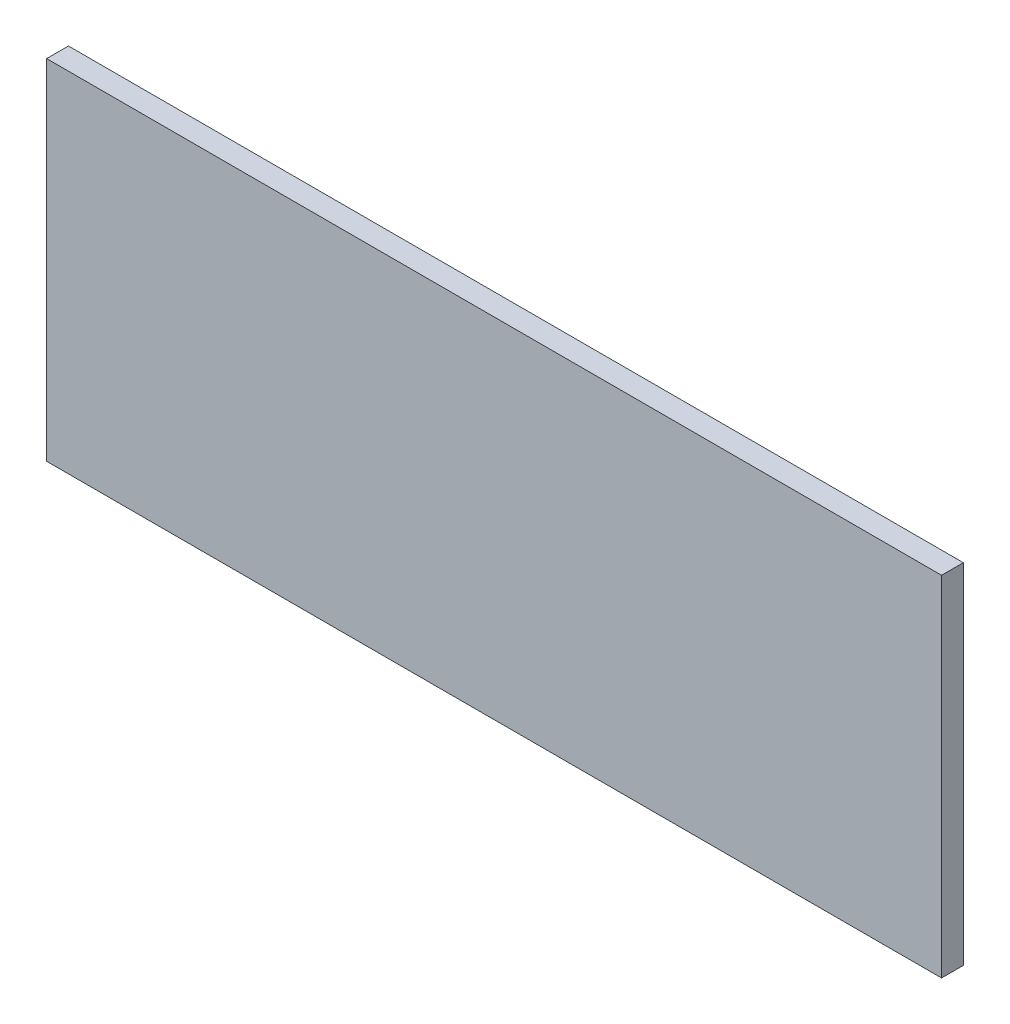
ISO-10303-21;
HEADER;
FILE_DESCRIPTION(('STEP AP214'),'2;1');
FILE_NAME('part.step','',(''),(''),'','','');
FILE_SCHEMA(('AUTOMOTIVE_DESIGN { 1 0 10303 214 1 1 1 1 }'));
ENDSEC;
DATA;
#1=APPLICATION_CONTEXT('core data for automotive mechanical design processes');
#2=APPLICATION_PROTOCOL_DEFINITION('international standard','automotive_design',2000,#1);
#3=PRODUCT_CONTEXT('',#1,'mechanical');
#4=PRODUCT('Part','Part','',(#3));
#5=PRODUCT_RELATED_PRODUCT_CATEGORY('part','',(#4));
#6=PRODUCT_DEFINITION_FORMATION('','',#4);
#7=PRODUCT_DEFINITION_CONTEXT('part definition',#1,'design');
#8=PRODUCT_DEFINITION('design','',#6,#7);
#9=PRODUCT_DEFINITION_SHAPE('','',#8);
#10=(LENGTH_UNIT() NAMED_UNIT(*) SI_UNIT(.MILLI.,.METRE.));
#11=(NAMED_UNIT(*) PLANE_ANGLE_UNIT() SI_UNIT($,.RADIAN.));
#12=(NAMED_UNIT(*) SI_UNIT($,.STERADIAN.) SOLID_ANGLE_UNIT());
#13=UNCERTAINTY_MEASURE_WITH_UNIT(LENGTH_MEASURE(1.E-05),#10,'distance_accuracy_value','');
#14=(GEOMETRIC_REPRESENTATION_CONTEXT(3) GLOBAL_UNCERTAINTY_ASSIGNED_CONTEXT((#13)) GLOBAL_UNIT_ASSIGNED_CONTEXT((#10,
#11,#12)) REPRESENTATION_CONTEXT('',''));
#15=CARTESIAN_POINT('',(0.,0.,0.));
#16=DIRECTION('',(0.,0.,1.));
#17=DIRECTION('',(1.,0.,0.));
#18=AXIS2_PLACEMENT_3D('',#15,#16,#17);
#19=CARTESIAN_POINT('',(-369.5,-144.,18.));
#20=DIRECTION('',(1.,0.,0.));
#21=DIRECTION('',(0.,0.,-1.));
#22=AXIS2_PLACEMENT_3D('',#19,#20,#21);
#23=PLANE('',#22);
#24=DIRECTION('',(0.,-1.,0.));
#25=VECTOR('',#24,1.);
#26=CARTESIAN_POINT('',(-369.5,-144.,0.));
#27=LINE('',#26,#25);
#28=CARTESIAN_POINT('',(-369.5,144.,0.));
#29=VERTEX_POINT('',#28);
#30=CARTESIAN_POINT('',(-369.5,-144.,0.));
#31=VERTEX_POINT('',#30);
#32=EDGE_CURVE('E96',#29,#31,#27,.T.);
#33=ORIENTED_EDGE('',*,*,#32,.T.);
#34=DIRECTION('',(0.,0.,-1.));
#35=VECTOR('',#34,1.);
#36=CARTESIAN_POINT('',(-369.5,-144.,18.));
#37=LINE('',#36,#35);
#38=CARTESIAN_POINT('',(-369.5,-144.,18.));
#39=VERTEX_POINT('',#38);
#40=EDGE_CURVE('E11',#39,#31,#37,.T.);
#41=ORIENTED_EDGE('',*,*,#40,.F.);
#42=DIRECTION('',(0.,-1.,0.));
#43=VECTOR('',#42,1.);
#44=CARTESIAN_POINT('',(-369.5,-144.,18.));
#45=LINE('',#44,#43);
#46=CARTESIAN_POINT('',(-369.5,144.,18.));
#47=VERTEX_POINT('',#46);
#48=EDGE_CURVE('E84',#47,#39,#45,.T.);
#49=ORIENTED_EDGE('',*,*,#48,.F.);
#50=DIRECTION('',(0.,0.,-1.));
#51=VECTOR('',#50,1.);
#52=CARTESIAN_POINT('',(-369.5,144.,18.));
#53=LINE('',#52,#51);
#54=EDGE_CURVE('E92',#47,#29,#53,.T.);
#55=ORIENTED_EDGE('',*,*,#54,.T.);
#56=EDGE_LOOP('',(#33,#41,#49,#55));
#57=FACE_BOUND('',#56,.T.);
#58=ADVANCED_FACE('F33',(#57),#23,.F.);
#59=CARTESIAN_POINT('',(369.5,-144.,18.));
#60=DIRECTION('',(0.,1.,0.));
#61=DIRECTION('',(-1.,0.,0.));
#62=AXIS2_PLACEMENT_3D('',#59,#60,#61);
#63=PLANE('',#62);
#64=DIRECTION('',(1.,0.,0.));
#65=VECTOR('',#64,1.);
#66=CARTESIAN_POINT('',(369.5,-144.,0.));
#67=LINE('',#66,#65);
#68=CARTESIAN_POINT('',(369.5,-144.,0.));
#69=VERTEX_POINT('',#68);
#70=EDGE_CURVE('E88',#31,#69,#67,.T.);
#71=ORIENTED_EDGE('',*,*,#70,.T.);
#72=DIRECTION('',(0.,0.,-1.));
#73=VECTOR('',#72,1.);
#74=CARTESIAN_POINT('',(369.5,-144.,18.));
#75=LINE('',#74,#73);
#76=CARTESIAN_POINT('',(369.5,-144.,18.));
#77=VERTEX_POINT('',#76);
#78=EDGE_CURVE('E41',#77,#69,#75,.T.);
#79=ORIENTED_EDGE('',*,*,#78,.F.);
#80=DIRECTION('',(1.,0.,0.));
#81=VECTOR('',#80,1.);
#82=CARTESIAN_POINT('',(369.5,-144.,18.));
#83=LINE('',#82,#81);
#84=EDGE_CURVE('E79',#39,#77,#83,.T.);
#85=ORIENTED_EDGE('',*,*,#84,.F.);
#86=ORIENTED_EDGE('',*,*,#40,.T.);
#87=EDGE_LOOP('',(#71,#79,#85,#86));
#88=FACE_BOUND('',#87,.T.);
#89=ADVANCED_FACE('F87',(#88),#63,.F.);
#90=CARTESIAN_POINT('',(369.5,-144.,18.));
#91=DIRECTION('',(-1.,0.,0.));
#92=DIRECTION('',(0.,0.,1.));
#93=AXIS2_PLACEMENT_3D('',#90,#91,#92);
#94=PLANE('',#93);
#95=DIRECTION('',(0.,1.,0.));
#96=VECTOR('',#95,1.);
#97=CARTESIAN_POINT('',(369.5,-144.,0.));
#98=LINE('',#97,#96);
#99=CARTESIAN_POINT('',(369.5,144.,0.));
#100=VERTEX_POINT('',#99);
#101=EDGE_CURVE('E66',#69,#100,#98,.T.);
#102=ORIENTED_EDGE('',*,*,#101,.T.);
#103=DIRECTION('',(0.,0.,-1.));
#104=VECTOR('',#103,1.);
#105=CARTESIAN_POINT('',(369.5,144.,18.));
#106=LINE('',#105,#104);
#107=CARTESIAN_POINT('',(369.5,144.,18.));
#108=VERTEX_POINT('',#107);
#109=EDGE_CURVE('E89',#108,#100,#106,.T.);
#110=ORIENTED_EDGE('',*,*,#109,.F.);
#111=DIRECTION('',(0.,1.,0.));
#112=VECTOR('',#111,1.);
#113=CARTESIAN_POINT('',(369.5,-144.,18.));
#114=LINE('',#113,#112);
#115=EDGE_CURVE('E82',#77,#108,#114,.T.);
#116=ORIENTED_EDGE('',*,*,#115,.F.);
#117=ORIENTED_EDGE('',*,*,#78,.T.);
#118=EDGE_LOOP('',(#102,#110,#116,#117));
#119=FACE_BOUND('',#118,.T.);
#120=ADVANCED_FACE('F90',(#119),#94,.F.);
#121=CARTESIAN_POINT('',(369.5,144.,18.));
#122=DIRECTION('',(0.,-1.,0.));
#123=DIRECTION('',(1.,0.,0.));
#124=AXIS2_PLACEMENT_3D('',#121,#122,#123);
#125=PLANE('',#124);
#126=DIRECTION('',(-1.,0.,0.));
#127=VECTOR('',#126,1.);
#128=CARTESIAN_POINT('',(369.5,144.,0.));
#129=LINE('',#128,#127);
#130=EDGE_CURVE('E72',#100,#29,#129,.T.);
#131=ORIENTED_EDGE('',*,*,#130,.T.);
#132=ORIENTED_EDGE('',*,*,#54,.F.);
#133=DIRECTION('',(-1.,0.,0.));
#134=VECTOR('',#133,1.);
#135=CARTESIAN_POINT('',(369.5,144.,18.));
#136=LINE('',#135,#134);
#137=EDGE_CURVE('E49',#108,#47,#136,.T.);
#138=ORIENTED_EDGE('',*,*,#137,.F.);
#139=ORIENTED_EDGE('',*,*,#109,.T.);
#140=EDGE_LOOP('',(#131,#132,#138,#139));
#141=FACE_BOUND('',#140,.T.);
#142=ADVANCED_FACE('F103',(#141),#125,.F.);
#143=CARTESIAN_POINT('',(0.,0.,18.));
#144=DIRECTION('',(0.,0.,1.));
#145=DIRECTION('',(1.,0.,0.));
#146=AXIS2_PLACEMENT_3D('',#143,#144,#145);
#147=PLANE('',#146);
#148=ORIENTED_EDGE('',*,*,#48,.T.);
#149=ORIENTED_EDGE('',*,*,#84,.T.);
#150=ORIENTED_EDGE('',*,*,#115,.T.);
#151=ORIENTED_EDGE('',*,*,#137,.T.);
#152=EDGE_LOOP('',(#148,#149,#150,#151));
#153=FACE_BOUND('',#152,.T.);
#154=ADVANCED_FACE('F80',(#153),#147,.T.);
#155=CARTESIAN_POINT('',(0.,0.,0.));
#156=DIRECTION('',(0.,0.,1.));
#157=DIRECTION('',(1.,0.,0.));
#158=AXIS2_PLACEMENT_3D('',#155,#156,#157);
#159=PLANE('',#158);
#160=ORIENTED_EDGE('',*,*,#32,.F.);
#161=ORIENTED_EDGE('',*,*,#130,.F.);
#162=ORIENTED_EDGE('',*,*,#101,.F.);
#163=ORIENTED_EDGE('',*,*,#70,.F.);
#164=EDGE_LOOP('',(#160,#161,#162,#163));
#165=FACE_BOUND('',#164,.T.);
#166=ADVANCED_FACE('F106',(#165),#159,.F.);
#167=CLOSED_SHELL('',(#58,#89,#120,#142,#154,#166));
#168=MANIFOLD_SOLID_BREP('B2',#167);
#169=ADVANCED_BREP_SHAPE_REPRESENTATION('',(#18,#168),#14);
#170=SHAPE_DEFINITION_REPRESENTATION(#9,#169);
ENDSEC;
END-ISO-10303-21;
